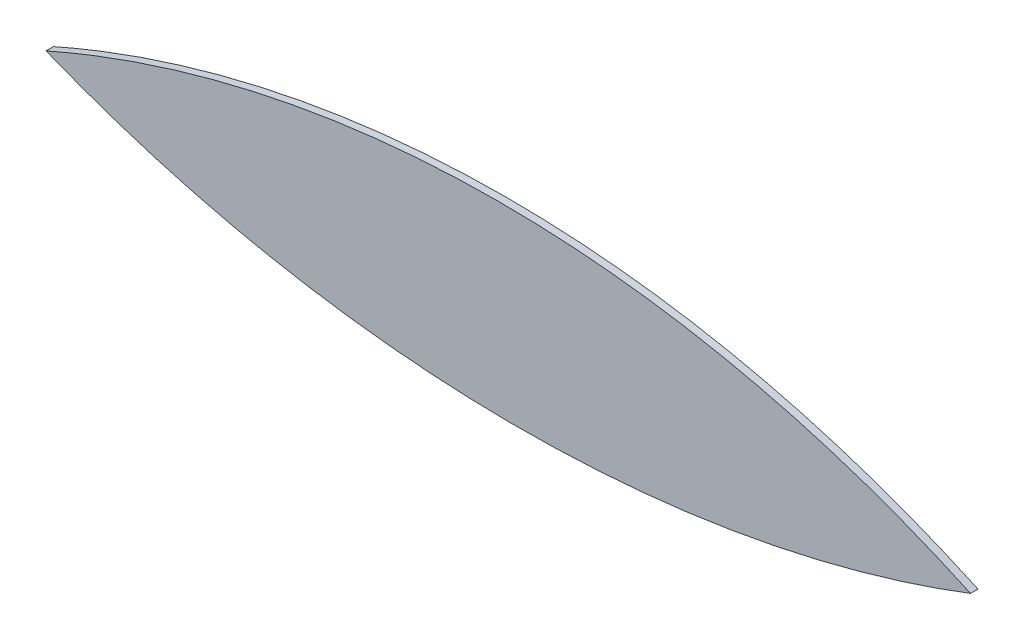
ISO-10303-21;
HEADER;
FILE_DESCRIPTION(('STEP AP214'),'2;1');
FILE_NAME('part.step','',(''),(''),'','','');
FILE_SCHEMA(('AUTOMOTIVE_DESIGN { 1 0 10303 214 1 1 1 1 }'));
ENDSEC;
DATA;
#1=APPLICATION_CONTEXT('core data for automotive mechanical design processes');
#2=APPLICATION_PROTOCOL_DEFINITION('international standard','automotive_design',2000,#1);
#3=PRODUCT_CONTEXT('',#1,'mechanical');
#4=PRODUCT('Part','Part','',(#3));
#5=PRODUCT_RELATED_PRODUCT_CATEGORY('part','',(#4));
#6=PRODUCT_DEFINITION_FORMATION('','',#4);
#7=PRODUCT_DEFINITION_CONTEXT('part definition',#1,'design');
#8=PRODUCT_DEFINITION('design','',#6,#7);
#9=PRODUCT_DEFINITION_SHAPE('','',#8);
#10=(LENGTH_UNIT() NAMED_UNIT(*) SI_UNIT(.MILLI.,.METRE.));
#11=(NAMED_UNIT(*) PLANE_ANGLE_UNIT() SI_UNIT($,.RADIAN.));
#12=(NAMED_UNIT(*) SI_UNIT($,.STERADIAN.) SOLID_ANGLE_UNIT());
#13=UNCERTAINTY_MEASURE_WITH_UNIT(LENGTH_MEASURE(1.E-05),#10,'distance_accuracy_value','');
#14=(GEOMETRIC_REPRESENTATION_CONTEXT(3) GLOBAL_UNCERTAINTY_ASSIGNED_CONTEXT((#13)) GLOBAL_UNIT_ASSIGNED_CONTEXT((#10,
#11,#12)) REPRESENTATION_CONTEXT('',''));
#15=CARTESIAN_POINT('',(0.,0.,0.));
#16=DIRECTION('',(0.,0.,1.));
#17=DIRECTION('',(1.,0.,0.));
#18=AXIS2_PLACEMENT_3D('',#15,#16,#17);
#19=CARTESIAN_POINT('',(46.6364018113676,26.9594562260818,0.1));
#20=CARTESIAN_POINT('',(52.790816709057,24.4738751651353,0.1));
#21=CARTESIAN_POINT('',(59.0077198107697,26.8578537487006,0.1));
#22=(BOUNDED_CURVE() B_SPLINE_CURVE(2,(#19,#20,#21),.UNSPECIFIED.,.F.,
.F.) B_SPLINE_CURVE_WITH_KNOTS((3,3),(0.,0.91448828685292),
.UNSPECIFIED.) CURVE() GEOMETRIC_REPRESENTATION_ITEM() RATIONAL_B_SPLINE_CURVE((1.,
0.897272550642614,1.)) REPRESENTATION_ITEM(''));
#23=DIRECTION('',(0.,0.,-1.));
#24=VECTOR('',#23,1.);
#25=SURFACE_OF_LINEAR_EXTRUSION('',#22,#24);
#26=CARTESIAN_POINT('',(46.6364018113676,26.9594562260818,0.));
#27=CARTESIAN_POINT('',(52.790816709057,24.4738751651353,0.));
#28=CARTESIAN_POINT('',(59.0077198107697,26.8578537487006,0.));
#29=(BOUNDED_CURVE() B_SPLINE_CURVE(2,(#26,#27,#28),.UNSPECIFIED.,.F.,
.F.) B_SPLINE_CURVE_WITH_KNOTS((3,3),(0.,0.91448828685292),
.UNSPECIFIED.) CURVE() GEOMETRIC_REPRESENTATION_ITEM() RATIONAL_B_SPLINE_CURVE((1.,
0.897272550642614,1.)) REPRESENTATION_ITEM(''));
#30=CARTESIAN_POINT('',(46.6364018113725,26.9594562260895,0.));
#31=VERTEX_POINT('',#30);
#32=CARTESIAN_POINT('',(59.0077198107697,26.8578537487006,0.));
#33=VERTEX_POINT('',#32);
#34=EDGE_CURVE('E65',#31,#33,#29,.T.);
#35=ORIENTED_EDGE('',*,*,#34,.T.);
#36=DIRECTION('',(0.,0.,-1.));
#37=VECTOR('',#36,1.);
#38=CARTESIAN_POINT('',(59.0077198107697,26.8578537487006,0.1));
#39=LINE('',#38,#37);
#40=CARTESIAN_POINT('',(59.0077198107697,26.8578537487006,0.1));
#41=VERTEX_POINT('',#40);
#42=EDGE_CURVE('E11',#41,#33,#39,.T.);
#43=ORIENTED_EDGE('',*,*,#42,.F.);
#44=CARTESIAN_POINT('',(46.6364018113725,26.9594562260895,0.1));
#45=VERTEX_POINT('',#44);
#46=EDGE_CURVE('E64',#45,#41,#22,.T.);
#47=ORIENTED_EDGE('',*,*,#46,.F.);
#48=DIRECTION('',(0.,0.,-1.));
#49=VECTOR('',#48,1.);
#50=CARTESIAN_POINT('',(46.6364018113725,26.9594562260895,0.1));
#51=LINE('',#50,#49);
#52=EDGE_CURVE('E42',#45,#31,#51,.T.);
#53=ORIENTED_EDGE('',*,*,#52,.T.);
#54=EDGE_LOOP('',(#35,#43,#47,#53));
#55=FACE_BOUND('',#54,.T.);
#56=ADVANCED_FACE('F33',(#55),#25,.F.);
#57=CARTESIAN_POINT('',(52.7097614942168,13.2348687217982,0.1));
#58=DIRECTION('',(0.,0.,-1.));
#59=DIRECTION('',(-1.,0.,0.));
#60=AXIS2_PLACEMENT_3D('',#57,#58,#59);
#61=CYLINDRICAL_SURFACE('',#60,15.0083310198102);
#62=CARTESIAN_POINT('',(59.0077198107697,26.8578537487006,0.));
#63=CARTESIAN_POINT('',(52.8450419468938,29.706883401775,0.));
#64=CARTESIAN_POINT('',(46.6364018113725,26.9594562260895,0.));
#65=(BOUNDED_CURVE() B_SPLINE_CURVE(2,(#62,#63,#64),.UNSPECIFIED.,.F.,
.F.) B_SPLINE_CURVE_WITH_KNOTS((3,3),(0.91448828685292,1.76414029440523),
.UNSPECIFIED.) CURVE() GEOMETRIC_REPRESENTATION_ITEM() RATIONAL_B_SPLINE_CURVE((1.,
0.911110461422003,1.)) REPRESENTATION_ITEM(''));
#66=EDGE_CURVE('E57',#33,#31,#65,.T.);
#67=ORIENTED_EDGE('',*,*,#66,.T.);
#68=ORIENTED_EDGE('',*,*,#52,.F.);
#69=CARTESIAN_POINT('',(59.0077198107697,26.8578537487006,0.1));
#70=CARTESIAN_POINT('',(52.8450419468938,29.706883401775,0.1));
#71=CARTESIAN_POINT('',(46.6364018113725,26.9594562260895,0.1));
#72=(BOUNDED_CURVE() B_SPLINE_CURVE(2,(#69,#70,#71),.UNSPECIFIED.,.F.,
.F.) B_SPLINE_CURVE_WITH_KNOTS((3,3),(0.91448828685292,1.76414029440523),
.UNSPECIFIED.) CURVE() GEOMETRIC_REPRESENTATION_ITEM() RATIONAL_B_SPLINE_CURVE((1.,
0.911110461422003,1.)) REPRESENTATION_ITEM(''));
#73=EDGE_CURVE('E49',#41,#45,#72,.T.);
#74=ORIENTED_EDGE('',*,*,#73,.F.);
#75=ORIENTED_EDGE('',*,*,#42,.T.);
#76=EDGE_LOOP('',(#67,#68,#74,#75));
#77=FACE_BOUND('',#76,.T.);
#78=ADVANCED_FACE('F60',(#77),#61,.T.);
#79=CARTESIAN_POINT('',(52.8072846129441,25.7571804137308,0.1));
#80=DIRECTION('',(0.,0.,-1.));
#81=DIRECTION('',(-1.,0.,0.));
#82=AXIS2_PLACEMENT_3D('',#79,#80,#81);
#83=PLANE('',#82);
#84=ORIENTED_EDGE('',*,*,#46,.T.);
#85=ORIENTED_EDGE('',*,*,#73,.T.);
#86=EDGE_LOOP('',(#84,#85));
#87=FACE_BOUND('',#86,.T.);
#88=ADVANCED_FACE('F92',(#87),#83,.F.);
#89=CARTESIAN_POINT('',(52.8072846129441,25.7571804137308,0.));
#90=DIRECTION('',(0.,0.,-1.));
#91=DIRECTION('',(-1.,0.,0.));
#92=AXIS2_PLACEMENT_3D('',#89,#90,#91);
#93=PLANE('',#92);
#94=ORIENTED_EDGE('',*,*,#34,.F.);
#95=ORIENTED_EDGE('',*,*,#66,.F.);
#96=EDGE_LOOP('',(#94,#95));
#97=FACE_BOUND('',#96,.T.);
#98=ADVANCED_FACE('F68',(#97),#93,.T.);
#99=CLOSED_SHELL('',(#56,#78,#88,#98));
#100=MANIFOLD_SOLID_BREP('B2',#99);
#101=ADVANCED_BREP_SHAPE_REPRESENTATION('',(#18,#100),#14);
#102=SHAPE_DEFINITION_REPRESENTATION(#9,#101);
ENDSEC;
END-ISO-10303-21;
